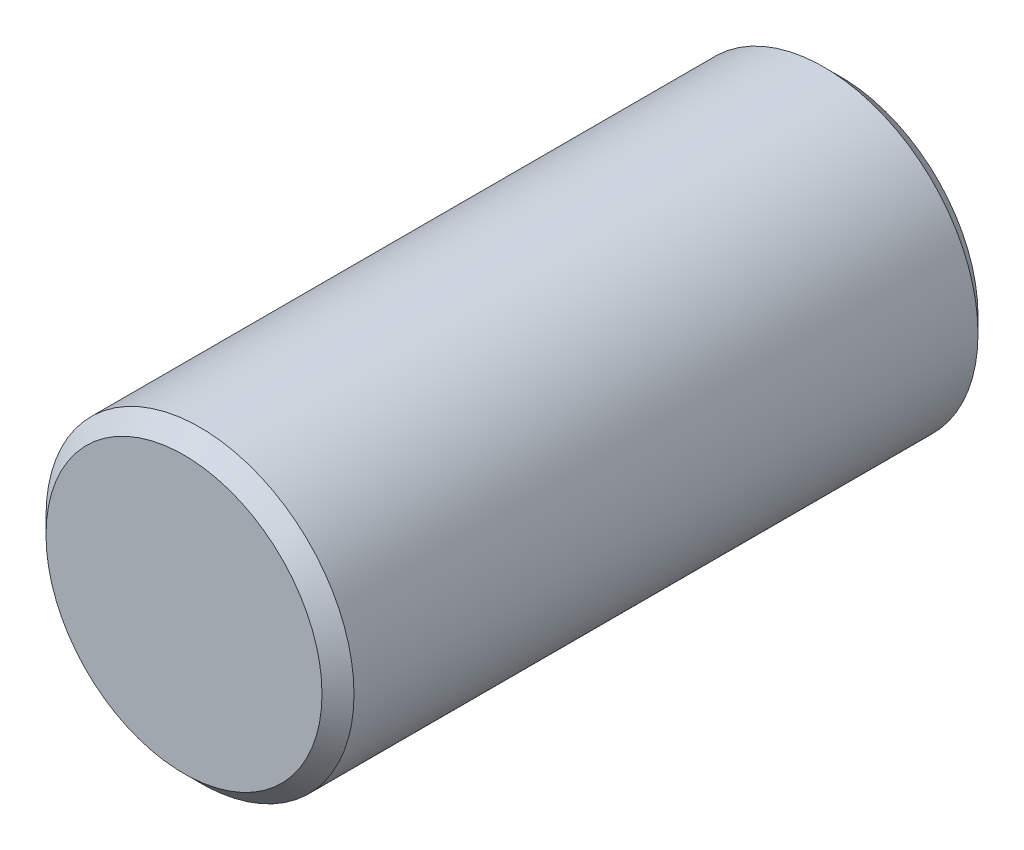
ISO-10303-21;
HEADER;
FILE_DESCRIPTION(('STEP AP214'),'2;1');
FILE_NAME('part.step','',(''),(''),'','','');
FILE_SCHEMA(('AUTOMOTIVE_DESIGN { 1 0 10303 214 1 1 1 1 }'));
ENDSEC;
DATA;
#1=APPLICATION_CONTEXT('core data for automotive mechanical design processes');
#2=APPLICATION_PROTOCOL_DEFINITION('international standard','automotive_design',2000,#1);
#3=PRODUCT_CONTEXT('',#1,'mechanical');
#4=PRODUCT('Part','Part','',(#3));
#5=PRODUCT_RELATED_PRODUCT_CATEGORY('part','',(#4));
#6=PRODUCT_DEFINITION_FORMATION('','',#4);
#7=PRODUCT_DEFINITION_CONTEXT('part definition',#1,'design');
#8=PRODUCT_DEFINITION('design','',#6,#7);
#9=PRODUCT_DEFINITION_SHAPE('','',#8);
#10=(LENGTH_UNIT() NAMED_UNIT(*) SI_UNIT(.MILLI.,.METRE.));
#11=(NAMED_UNIT(*) PLANE_ANGLE_UNIT() SI_UNIT($,.RADIAN.));
#12=(NAMED_UNIT(*) SI_UNIT($,.STERADIAN.) SOLID_ANGLE_UNIT());
#13=UNCERTAINTY_MEASURE_WITH_UNIT(LENGTH_MEASURE(1.E-05),#10,'distance_accuracy_value','');
#14=(GEOMETRIC_REPRESENTATION_CONTEXT(3) GLOBAL_UNCERTAINTY_ASSIGNED_CONTEXT((#13)) GLOBAL_UNIT_ASSIGNED_CONTEXT((#10,
#11,#12)) REPRESENTATION_CONTEXT('',''));
#15=CARTESIAN_POINT('',(0.,0.,0.));
#16=DIRECTION('',(0.,0.,1.));
#17=DIRECTION('',(1.,0.,0.));
#18=AXIS2_PLACEMENT_3D('',#15,#16,#17);
#19=CARTESIAN_POINT('',(0.,0.,41.));
#20=DIRECTION('',(0.,0.,-1.));
#21=DIRECTION('',(-1.,0.,0.));
#22=AXIS2_PLACEMENT_3D('',#19,#20,#21);
#23=CYLINDRICAL_SURFACE('',#22,19.25);
#24=CARTESIAN_POINT('',(0.,0.,39.));
#25=DIRECTION('',(0.,0.,1.));
#26=DIRECTION('',(1.,0.,0.));
#27=AXIS2_PLACEMENT_3D('',#24,#25,#26);
#28=CIRCLE('',#27,19.25);
#29=CARTESIAN_POINT('',(19.25,0.,39.));
#30=VERTEX_POINT('',#29);
#31=EDGE_CURVE('E52',#30,#30,#28,.F.);
#32=ORIENTED_EDGE('',*,*,#31,.T.);
#33=EDGE_LOOP('',(#32));
#34=FACE_BOUND('',#33,.T.);
#35=CARTESIAN_POINT('',(0.,0.,-39.));
#36=DIRECTION('',(0.,0.,1.));
#37=DIRECTION('',(1.,0.,0.));
#38=AXIS2_PLACEMENT_3D('',#35,#36,#37);
#39=CIRCLE('',#38,19.25);
#40=CARTESIAN_POINT('',(19.25,0.,-39.));
#41=VERTEX_POINT('',#40);
#42=EDGE_CURVE('E57',#41,#41,#39,.T.);
#43=ORIENTED_EDGE('',*,*,#42,.T.);
#44=EDGE_LOOP('',(#43));
#45=FACE_BOUND('',#44,.T.);
#46=ADVANCED_FACE('F43',(#34,#45),#23,.T.);
#47=CARTESIAN_POINT('',(0.,0.,41.));
#48=DIRECTION('',(0.,0.,1.));
#49=DIRECTION('',(1.,0.,0.));
#50=AXIS2_PLACEMENT_3D('',#47,#48,#49);
#51=PLANE('',#50);
#52=CARTESIAN_POINT('',(0.,0.,41.));
#53=DIRECTION('',(0.,0.,1.));
#54=DIRECTION('',(1.,0.,0.));
#55=AXIS2_PLACEMENT_3D('',#52,#53,#54);
#56=CIRCLE('',#55,17.25);
#57=CARTESIAN_POINT('',(17.25,0.,41.));
#58=VERTEX_POINT('',#57);
#59=EDGE_CURVE('E62',#58,#58,#56,.T.);
#60=ORIENTED_EDGE('',*,*,#59,.T.);
#61=EDGE_LOOP('',(#60));
#62=FACE_BOUND('',#61,.T.);
#63=ADVANCED_FACE('F69',(#62),#51,.T.);
#64=CARTESIAN_POINT('',(0.,0.,-41.));
#65=DIRECTION('',(0.,0.,1.));
#66=DIRECTION('',(1.,0.,0.));
#67=AXIS2_PLACEMENT_3D('',#64,#65,#66);
#68=PLANE('',#67);
#69=CARTESIAN_POINT('',(0.,0.,-41.));
#70=DIRECTION('',(0.,0.,1.));
#71=DIRECTION('',(1.,0.,0.));
#72=AXIS2_PLACEMENT_3D('',#69,#70,#71);
#73=CIRCLE('',#72,17.25);
#74=CARTESIAN_POINT('',(17.25,0.,-41.));
#75=VERTEX_POINT('',#74);
#76=EDGE_CURVE('E10',#75,#75,#73,.F.);
#77=ORIENTED_EDGE('',*,*,#76,.T.);
#78=EDGE_LOOP('',(#77));
#79=FACE_BOUND('',#78,.T.);
#80=ADVANCED_FACE('F73',(#79),#68,.F.);
#81=CARTESIAN_POINT('',(0.,0.,41.));
#82=DIRECTION('',(0.,0.,-1.));
#83=DIRECTION('',(-1.,0.,0.));
#84=AXIS2_PLACEMENT_3D('',#81,#82,#83);
#85=CONICAL_SURFACE('',#84,17.25,0.785398163397446);
#86=ORIENTED_EDGE('',*,*,#31,.F.);
#87=EDGE_LOOP('',(#86));
#88=FACE_BOUND('',#87,.T.);
#89=ORIENTED_EDGE('',*,*,#59,.F.);
#90=EDGE_LOOP('',(#89));
#91=FACE_BOUND('',#90,.T.);
#92=ADVANCED_FACE('F71',(#88,#91),#85,.T.);
#93=CARTESIAN_POINT('',(0.,0.,-39.));
#94=DIRECTION('',(0.,0.,1.));
#95=DIRECTION('',(1.,0.,0.));
#96=AXIS2_PLACEMENT_3D('',#93,#94,#95);
#97=CONICAL_SURFACE('',#96,19.25,0.785398163397451);
#98=ORIENTED_EDGE('',*,*,#76,.F.);
#99=EDGE_LOOP('',(#98));
#100=FACE_BOUND('',#99,.T.);
#101=ORIENTED_EDGE('',*,*,#42,.F.);
#102=EDGE_LOOP('',(#101));
#103=FACE_BOUND('',#102,.T.);
#104=ADVANCED_FACE('F46',(#100,#103),#97,.T.);
#105=CLOSED_SHELL('',(#46,#63,#80,#92,#104));
#106=MANIFOLD_SOLID_BREP('B2',#105);
#107=ADVANCED_BREP_SHAPE_REPRESENTATION('',(#18,#106),#14);
#108=SHAPE_DEFINITION_REPRESENTATION(#9,#107);
ENDSEC;
END-ISO-10303-21;
